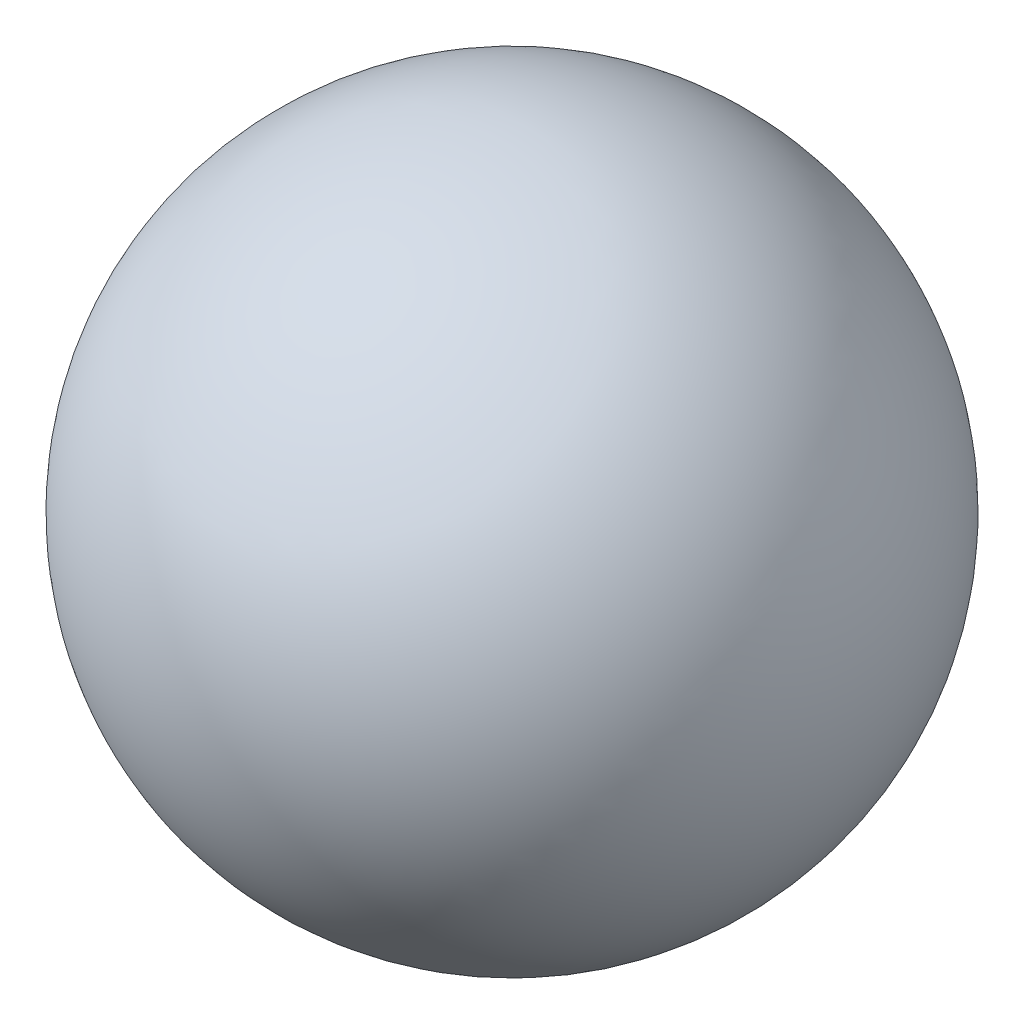
ISO-10303-21;
HEADER;
FILE_DESCRIPTION(('STEP AP214'),'2;1');
FILE_NAME('part.step','',(''),(''),'','','');
FILE_SCHEMA(('AUTOMOTIVE_DESIGN { 1 0 10303 214 1 1 1 1 }'));
ENDSEC;
DATA;
#1=APPLICATION_CONTEXT('core data for automotive mechanical design processes');
#2=APPLICATION_PROTOCOL_DEFINITION('international standard','automotive_design',2000,#1);
#3=PRODUCT_CONTEXT('',#1,'mechanical');
#4=PRODUCT('Part','Part','',(#3));
#5=PRODUCT_RELATED_PRODUCT_CATEGORY('part','',(#4));
#6=PRODUCT_DEFINITION_FORMATION('','',#4);
#7=PRODUCT_DEFINITION_CONTEXT('part definition',#1,'design');
#8=PRODUCT_DEFINITION('design','',#6,#7);
#9=PRODUCT_DEFINITION_SHAPE('','',#8);
#10=(LENGTH_UNIT() NAMED_UNIT(*) SI_UNIT(.MILLI.,.METRE.));
#11=(NAMED_UNIT(*) PLANE_ANGLE_UNIT() SI_UNIT($,.RADIAN.));
#12=(NAMED_UNIT(*) SI_UNIT($,.STERADIAN.) SOLID_ANGLE_UNIT());
#13=UNCERTAINTY_MEASURE_WITH_UNIT(LENGTH_MEASURE(1.E-05),#10,'distance_accuracy_value','');
#14=(GEOMETRIC_REPRESENTATION_CONTEXT(3) GLOBAL_UNCERTAINTY_ASSIGNED_CONTEXT((#13)) GLOBAL_UNIT_ASSIGNED_CONTEXT((#10,
#11,#12)) REPRESENTATION_CONTEXT('',''));
#15=CARTESIAN_POINT('',(0.,0.,0.));
#16=DIRECTION('',(0.,0.,1.));
#17=DIRECTION('',(1.,0.,0.));
#18=AXIS2_PLACEMENT_3D('',#15,#16,#17);
#19=CARTESIAN_POINT('',(-2.22370212123482,-2.,11.5376621928368));
#20=DIRECTION('',(0.,0.,1.));
#21=DIRECTION('',(1.,0.,0.));
#22=AXIS2_PLACEMENT_3D('',#19,#20,#21);
#23=SPHERICAL_SURFACE('',#22,1.05);
#24=CARTESIAN_POINT('',(-2.22370212123482,-2.,12.5876621928368));
#25=VERTEX_POINT('',#24);
#26=VERTEX_LOOP('',#25);
#27=FACE_BOUND('',#26,.T.);
#28=ADVANCED_FACE('F13',(#27),#23,.T.);
#29=CLOSED_SHELL('',(#28));
#30=MANIFOLD_SOLID_BREP('B1',#29);
#31=ADVANCED_BREP_SHAPE_REPRESENTATION('',(#18,#30),#14);
#32=SHAPE_DEFINITION_REPRESENTATION(#9,#31);
ENDSEC;
END-ISO-10303-21;
